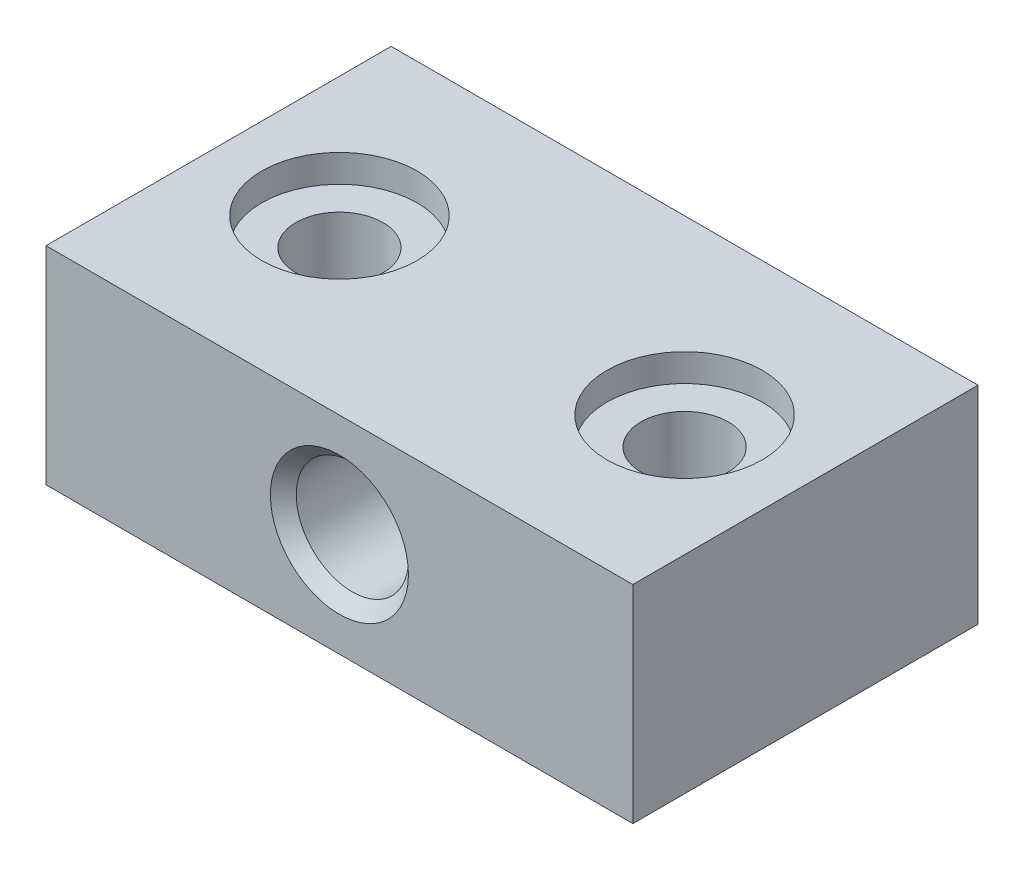
ISO-10303-21;
HEADER;
FILE_DESCRIPTION(('STEP AP214'),'2;1');
FILE_NAME('part.step','',(''),(''),'','','');
FILE_SCHEMA(('AUTOMOTIVE_DESIGN { 1 0 10303 214 1 1 1 1 }'));
ENDSEC;
DATA;
#1=APPLICATION_CONTEXT('core data for automotive mechanical design processes');
#2=APPLICATION_PROTOCOL_DEFINITION('international standard','automotive_design',2000,#1);
#3=PRODUCT_CONTEXT('',#1,'mechanical');
#4=PRODUCT('Part','Part','',(#3));
#5=PRODUCT_RELATED_PRODUCT_CATEGORY('part','',(#4));
#6=PRODUCT_DEFINITION_FORMATION('','',#4);
#7=PRODUCT_DEFINITION_CONTEXT('part definition',#1,'design');
#8=PRODUCT_DEFINITION('design','',#6,#7);
#9=PRODUCT_DEFINITION_SHAPE('','',#8);
#10=(LENGTH_UNIT() NAMED_UNIT(*) SI_UNIT(.MILLI.,.METRE.));
#11=(NAMED_UNIT(*) PLANE_ANGLE_UNIT() SI_UNIT($,.RADIAN.));
#12=(NAMED_UNIT(*) SI_UNIT($,.STERADIAN.) SOLID_ANGLE_UNIT());
#13=UNCERTAINTY_MEASURE_WITH_UNIT(LENGTH_MEASURE(1.E-05),#10,'distance_accuracy_value','');
#14=(GEOMETRIC_REPRESENTATION_CONTEXT(3) GLOBAL_UNCERTAINTY_ASSIGNED_CONTEXT((#13)) GLOBAL_UNIT_ASSIGNED_CONTEXT((#10,
#11,#12)) REPRESENTATION_CONTEXT('',''));
#15=CARTESIAN_POINT('',(0.,0.,0.));
#16=DIRECTION('',(0.,0.,1.));
#17=DIRECTION('',(1.,0.,0.));
#18=AXIS2_PLACEMENT_3D('',#15,#16,#17);
#19=CARTESIAN_POINT('',(-10.,-14.,-10.));
#20=DIRECTION('',(0.,1.,0.));
#21=DIRECTION('',(0.,0.,1.));
#22=AXIS2_PLACEMENT_3D('',#19,#20,#21);
#23=CYLINDRICAL_SURFACE('',#22,2.525);
#24=CARTESIAN_POINT('',(-10.,4.4,-10.));
#25=DIRECTION('',(0.,1.,0.));
#26=DIRECTION('',(0.,0.,1.));
#27=AXIS2_PLACEMENT_3D('',#24,#25,#26);
#28=CIRCLE('',#27,2.525);
#29=CARTESIAN_POINT('',(-10.,4.4,-7.475));
#30=VERTEX_POINT('',#29);
#31=EDGE_CURVE('E251',#30,#30,#28,.F.);
#32=ORIENTED_EDGE('',*,*,#31,.F.);
#33=EDGE_LOOP('',(#32));
#34=FACE_BOUND('',#33,.T.);
#35=CARTESIAN_POINT('',(-10.,-1.03,-10.));
#36=DIRECTION('',(0.,-1.,0.));
#37=DIRECTION('',(0.,0.,-1.));
#38=AXIS2_PLACEMENT_3D('',#35,#36,#37);
#39=CIRCLE('',#38,2.525);
#40=CARTESIAN_POINT('',(-10.,-1.03,-12.525));
#41=VERTEX_POINT('',#40);
#42=EDGE_CURVE('E193',#41,#41,#39,.F.);
#43=ORIENTED_EDGE('',*,*,#42,.F.);
#44=EDGE_LOOP('',(#43));
#45=FACE_BOUND('',#44,.T.);
#46=ADVANCED_FACE('F32',(#34,#45),#23,.F.);
#47=CARTESIAN_POINT('',(10.,-14.,-10.));
#48=DIRECTION('',(0.,1.,0.));
#49=DIRECTION('',(0.,0.,1.));
#50=AXIS2_PLACEMENT_3D('',#47,#48,#49);
#51=CYLINDRICAL_SURFACE('',#50,2.525);
#52=CARTESIAN_POINT('',(10.,4.4,-10.));
#53=DIRECTION('',(0.,1.,0.));
#54=DIRECTION('',(0.,0.,1.));
#55=AXIS2_PLACEMENT_3D('',#52,#53,#54);
#56=CIRCLE('',#55,2.525);
#57=CARTESIAN_POINT('',(10.,4.4,-7.475));
#58=VERTEX_POINT('',#57);
#59=EDGE_CURVE('E258',#58,#58,#56,.F.);
#60=ORIENTED_EDGE('',*,*,#59,.F.);
#61=EDGE_LOOP('',(#60));
#62=FACE_BOUND('',#61,.T.);
#63=CARTESIAN_POINT('',(10.,-1.03,-10.));
#64=DIRECTION('',(0.,-1.,0.));
#65=DIRECTION('',(0.,0.,-1.));
#66=AXIS2_PLACEMENT_3D('',#63,#64,#65);
#67=CIRCLE('',#66,2.525);
#68=CARTESIAN_POINT('',(10.,-1.03,-12.525));
#69=VERTEX_POINT('',#68);
#70=EDGE_CURVE('E238',#69,#69,#67,.F.);
#71=ORIENTED_EDGE('',*,*,#70,.F.);
#72=EDGE_LOOP('',(#71));
#73=FACE_BOUND('',#72,.T.);
#74=ADVANCED_FACE('F322',(#62,#73),#51,.F.);
#75=CARTESIAN_POINT('',(17.,6.,-20.));
#76=DIRECTION('',(1.,0.,0.));
#77=DIRECTION('',(0.,0.,-1.));
#78=AXIS2_PLACEMENT_3D('',#75,#76,#77);
#79=PLANE('',#78);
#80=DIRECTION('',(0.,1.,0.));
#81=VECTOR('',#80,1.);
#82=CARTESIAN_POINT('',(17.,6.,0.));
#83=LINE('',#82,#81);
#84=CARTESIAN_POINT('',(17.,-6.,0.));
#85=VERTEX_POINT('',#84);
#86=CARTESIAN_POINT('',(17.,6.,0.));
#87=VERTEX_POINT('',#86);
#88=EDGE_CURVE('E276',#85,#87,#83,.T.);
#89=ORIENTED_EDGE('',*,*,#88,.F.);
#90=DIRECTION('',(0.,0.,1.));
#91=VECTOR('',#90,1.);
#92=CARTESIAN_POINT('',(17.,-6.,-20.));
#93=LINE('',#92,#91);
#94=CARTESIAN_POINT('',(17.,-6.,-20.));
#95=VERTEX_POINT('',#94);
#96=EDGE_CURVE('E287',#95,#85,#93,.T.);
#97=ORIENTED_EDGE('',*,*,#96,.F.);
#98=DIRECTION('',(0.,1.,0.));
#99=VECTOR('',#98,1.);
#100=CARTESIAN_POINT('',(17.,6.,-20.));
#101=LINE('',#100,#99);
#102=CARTESIAN_POINT('',(17.,6.,-20.));
#103=VERTEX_POINT('',#102);
#104=EDGE_CURVE('E262',#95,#103,#101,.T.);
#105=ORIENTED_EDGE('',*,*,#104,.T.);
#106=DIRECTION('',(0.,0.,1.));
#107=VECTOR('',#106,1.);
#108=CARTESIAN_POINT('',(17.,6.,-20.));
#109=LINE('',#108,#107);
#110=EDGE_CURVE('E275',#103,#87,#109,.T.);
#111=ORIENTED_EDGE('',*,*,#110,.T.);
#112=EDGE_LOOP('',(#89,#97,#105,#111));
#113=FACE_BOUND('',#112,.T.);
#114=ADVANCED_FACE('F328',(#113),#79,.T.);
#115=CARTESIAN_POINT('',(-17.,-6.,-20.));
#116=DIRECTION('',(0.,-1.,0.));
#117=DIRECTION('',(0.,0.,-1.));
#118=AXIS2_PLACEMENT_3D('',#115,#116,#117);
#119=PLANE('',#118);
#120=DIRECTION('',(-0.866025403784439,0.,0.5));
#121=VECTOR('',#120,1.);
#122=CARTESIAN_POINT('',(-5.99896263451589,-6.,-7.69));
#123=LINE('',#122,#121);
#124=CARTESIAN_POINT('',(-5.99896263451589,-6.,-7.69));
#125=VERTEX_POINT('',#124);
#126=CARTESIAN_POINT('',(-10.,-6.,-5.38));
#127=VERTEX_POINT('',#126);
#128=EDGE_CURVE('E47',#125,#127,#123,.T.);
#129=ORIENTED_EDGE('',*,*,#128,.F.);
#130=DIRECTION('',(0.,0.,1.));
#131=VECTOR('',#130,1.);
#132=CARTESIAN_POINT('',(-5.99896263451589,-6.,-12.31));
#133=LINE('',#132,#131);
#134=CARTESIAN_POINT('',(-5.99896263451589,-6.,-12.31));
#135=VERTEX_POINT('',#134);
#136=EDGE_CURVE('E167',#135,#125,#133,.T.);
#137=ORIENTED_EDGE('',*,*,#136,.F.);
#138=DIRECTION('',(0.866025403784439,0.,0.5));
#139=VECTOR('',#138,1.);
#140=CARTESIAN_POINT('',(-10.,-6.,-14.62));
#141=LINE('',#140,#139);
#142=CARTESIAN_POINT('',(-10.,-6.,-14.62));
#143=VERTEX_POINT('',#142);
#144=EDGE_CURVE('E170',#143,#135,#141,.T.);
#145=ORIENTED_EDGE('',*,*,#144,.F.);
#146=DIRECTION('',(0.866025403784439,0.,-0.5));
#147=VECTOR('',#146,1.);
#148=CARTESIAN_POINT('',(-14.0010373654841,-6.,-12.31));
#149=LINE('',#148,#147);
#150=CARTESIAN_POINT('',(-14.0010373654841,-6.,-12.31));
#151=VERTEX_POINT('',#150);
#152=EDGE_CURVE('E186',#151,#143,#149,.T.);
#153=ORIENTED_EDGE('',*,*,#152,.F.);
#154=DIRECTION('',(0.,0.,-1.));
#155=VECTOR('',#154,1.);
#156=CARTESIAN_POINT('',(-14.0010373654841,-6.,-7.69));
#157=LINE('',#156,#155);
#158=CARTESIAN_POINT('',(-14.0010373654841,-6.,-7.69));
#159=VERTEX_POINT('',#158);
#160=EDGE_CURVE('E183',#159,#151,#157,.T.);
#161=ORIENTED_EDGE('',*,*,#160,.F.);
#162=DIRECTION('',(-0.866025403784439,0.,-0.5));
#163=VECTOR('',#162,1.);
#164=CARTESIAN_POINT('',(-10.,-6.,-5.38));
#165=LINE('',#164,#163);
#166=EDGE_CURVE('E181',#127,#159,#165,.T.);
#167=ORIENTED_EDGE('',*,*,#166,.F.);
#168=EDGE_LOOP('',(#129,#137,#145,#153,#161,#167));
#169=FACE_BOUND('',#168,.T.);
#170=DIRECTION('',(-0.866025403784438,0.,0.5));
#171=VECTOR('',#170,1.);
#172=CARTESIAN_POINT('',(14.0010373654841,-6.,-7.69));
#173=LINE('',#172,#171);
#174=CARTESIAN_POINT('',(14.0010373654841,-6.,-7.69));
#175=VERTEX_POINT('',#174);
#176=CARTESIAN_POINT('',(10.,-6.,-5.38));
#177=VERTEX_POINT('',#176);
#178=EDGE_CURVE('E55',#175,#177,#173,.T.);
#179=ORIENTED_EDGE('',*,*,#178,.F.);
#180=DIRECTION('',(0.,0.,1.));
#181=VECTOR('',#180,1.);
#182=CARTESIAN_POINT('',(14.0010373654841,-6.,-12.31));
#183=LINE('',#182,#181);
#184=CARTESIAN_POINT('',(14.0010373654841,-6.,-12.31));
#185=VERTEX_POINT('',#184);
#186=EDGE_CURVE('E205',#185,#175,#183,.T.);
#187=ORIENTED_EDGE('',*,*,#186,.F.);
#188=DIRECTION('',(0.866025403784439,0.,0.5));
#189=VECTOR('',#188,1.);
#190=CARTESIAN_POINT('',(10.,-6.,-14.62));
#191=LINE('',#190,#189);
#192=CARTESIAN_POINT('',(10.,-6.,-14.62));
#193=VERTEX_POINT('',#192);
#194=EDGE_CURVE('E231',#193,#185,#191,.T.);
#195=ORIENTED_EDGE('',*,*,#194,.F.);
#196=DIRECTION('',(0.866025403784439,0.,-0.5));
#197=VECTOR('',#196,1.);
#198=CARTESIAN_POINT('',(5.99896263451589,-6.,-12.31));
#199=LINE('',#198,#197);
#200=CARTESIAN_POINT('',(5.99896263451589,-6.,-12.31));
#201=VERTEX_POINT('',#200);
#202=EDGE_CURVE('E228',#201,#193,#199,.T.);
#203=ORIENTED_EDGE('',*,*,#202,.F.);
#204=DIRECTION('',(0.,0.,-1.));
#205=VECTOR('',#204,1.);
#206=CARTESIAN_POINT('',(5.99896263451589,-6.,-7.69));
#207=LINE('',#206,#205);
#208=CARTESIAN_POINT('',(5.99896263451589,-6.,-7.69));
#209=VERTEX_POINT('',#208);
#210=EDGE_CURVE('E225',#209,#201,#207,.T.);
#211=ORIENTED_EDGE('',*,*,#210,.F.);
#212=DIRECTION('',(-0.866025403784439,0.,-0.5));
#213=VECTOR('',#212,1.);
#214=CARTESIAN_POINT('',(10.,-6.,-5.38));
#215=LINE('',#214,#213);
#216=EDGE_CURVE('E222',#177,#209,#215,.T.);
#217=ORIENTED_EDGE('',*,*,#216,.F.);
#218=EDGE_LOOP('',(#179,#187,#195,#203,#211,#217));
#219=FACE_BOUND('',#218,.T.);
#220=DIRECTION('',(1.,0.,0.));
#221=VECTOR('',#220,1.);
#222=CARTESIAN_POINT('',(-17.,-6.,0.));
#223=LINE('',#222,#221);
#224=CARTESIAN_POINT('',(-17.,-6.,0.));
#225=VERTEX_POINT('',#224);
#226=EDGE_CURVE('E266',#225,#85,#223,.T.);
#227=ORIENTED_EDGE('',*,*,#226,.F.);
#228=DIRECTION('',(0.,0.,1.));
#229=VECTOR('',#228,1.);
#230=CARTESIAN_POINT('',(-17.,-6.,-20.));
#231=LINE('',#230,#229);
#232=CARTESIAN_POINT('',(-17.,-6.,-20.));
#233=VERTEX_POINT('',#232);
#234=EDGE_CURVE('E290',#233,#225,#231,.T.);
#235=ORIENTED_EDGE('',*,*,#234,.F.);
#236=DIRECTION('',(1.,0.,0.));
#237=VECTOR('',#236,1.);
#238=CARTESIAN_POINT('',(-17.,-6.,-20.));
#239=LINE('',#238,#237);
#240=EDGE_CURVE('E272',#233,#95,#239,.T.);
#241=ORIENTED_EDGE('',*,*,#240,.T.);
#242=ORIENTED_EDGE('',*,*,#96,.T.);
#243=EDGE_LOOP('',(#227,#235,#241,#242));
#244=FACE_BOUND('',#243,.T.);
#245=ADVANCED_FACE('F347',(#169,#219,#244),#119,.T.);
#246=CARTESIAN_POINT('',(-17.,6.,-20.));
#247=DIRECTION('',(-1.,0.,0.));
#248=DIRECTION('',(0.,0.,1.));
#249=AXIS2_PLACEMENT_3D('',#246,#247,#248);
#250=PLANE('',#249);
#251=DIRECTION('',(0.,-1.,0.));
#252=VECTOR('',#251,1.);
#253=CARTESIAN_POINT('',(-17.,6.,0.));
#254=LINE('',#253,#252);
#255=CARTESIAN_POINT('',(-17.,6.,0.));
#256=VERTEX_POINT('',#255);
#257=EDGE_CURVE('E282',#256,#225,#254,.T.);
#258=ORIENTED_EDGE('',*,*,#257,.F.);
#259=DIRECTION('',(0.,0.,1.));
#260=VECTOR('',#259,1.);
#261=CARTESIAN_POINT('',(-17.,6.,-20.));
#262=LINE('',#261,#260);
#263=CARTESIAN_POINT('',(-17.,6.,-20.));
#264=VERTEX_POINT('',#263);
#265=EDGE_CURVE('E292',#264,#256,#262,.T.);
#266=ORIENTED_EDGE('',*,*,#265,.F.);
#267=DIRECTION('',(0.,-1.,0.));
#268=VECTOR('',#267,1.);
#269=CARTESIAN_POINT('',(-17.,6.,-20.));
#270=LINE('',#269,#268);
#271=EDGE_CURVE('E269',#264,#233,#270,.T.);
#272=ORIENTED_EDGE('',*,*,#271,.T.);
#273=ORIENTED_EDGE('',*,*,#234,.T.);
#274=EDGE_LOOP('',(#258,#266,#272,#273));
#275=FACE_BOUND('',#274,.T.);
#276=ADVANCED_FACE('F350',(#275),#250,.T.);
#277=CARTESIAN_POINT('',(-17.,6.,-20.));
#278=DIRECTION('',(0.,1.,0.));
#279=DIRECTION('',(0.,0.,1.));
#280=AXIS2_PLACEMENT_3D('',#277,#278,#279);
#281=PLANE('',#280);
#282=CARTESIAN_POINT('',(-10.,6.,-10.));
#283=DIRECTION('',(0.,1.,0.));
#284=DIRECTION('',(0.,0.,1.));
#285=AXIS2_PLACEMENT_3D('',#282,#283,#284);
#286=CIRCLE('',#285,4.5);
#287=CARTESIAN_POINT('',(-10.,6.,-5.5));
#288=VERTEX_POINT('',#287);
#289=EDGE_CURVE('E252',#288,#288,#286,.T.);
#290=ORIENTED_EDGE('',*,*,#289,.F.);
#291=EDGE_LOOP('',(#290));
#292=FACE_BOUND('',#291,.T.);
#293=CARTESIAN_POINT('',(10.,6.,-10.));
#294=DIRECTION('',(0.,1.,0.));
#295=DIRECTION('',(0.,0.,1.));
#296=AXIS2_PLACEMENT_3D('',#293,#294,#295);
#297=CIRCLE('',#296,4.5);
#298=CARTESIAN_POINT('',(10.,6.,-5.5));
#299=VERTEX_POINT('',#298);
#300=EDGE_CURVE('E259',#299,#299,#297,.T.);
#301=ORIENTED_EDGE('',*,*,#300,.F.);
#302=EDGE_LOOP('',(#301));
#303=FACE_BOUND('',#302,.T.);
#304=DIRECTION('',(-1.,0.,0.));
#305=VECTOR('',#304,1.);
#306=CARTESIAN_POINT('',(-17.,6.,0.));
#307=LINE('',#306,#305);
#308=EDGE_CURVE('E279',#87,#256,#307,.T.);
#309=ORIENTED_EDGE('',*,*,#308,.F.);
#310=ORIENTED_EDGE('',*,*,#110,.F.);
#311=DIRECTION('',(-1.,0.,0.));
#312=VECTOR('',#311,1.);
#313=CARTESIAN_POINT('',(-17.,6.,-20.));
#314=LINE('',#313,#312);
#315=EDGE_CURVE('E265',#103,#264,#314,.T.);
#316=ORIENTED_EDGE('',*,*,#315,.T.);
#317=ORIENTED_EDGE('',*,*,#265,.T.);
#318=EDGE_LOOP('',(#309,#310,#316,#317));
#319=FACE_BOUND('',#318,.T.);
#320=ADVANCED_FACE('F342',(#292,#303,#319),#281,.T.);
#321=CARTESIAN_POINT('',(0.,0.,-20.));
#322=DIRECTION('',(0.,0.,1.));
#323=DIRECTION('',(1.,0.,0.));
#324=AXIS2_PLACEMENT_3D('',#321,#322,#323);
#325=PLANE('',#324);
#326=CARTESIAN_POINT('',(0.,0.,-20.));
#327=DIRECTION('',(0.,0.,1.));
#328=DIRECTION('',(1.,0.,0.));
#329=AXIS2_PLACEMENT_3D('',#326,#327,#328);
#330=CIRCLE('',#329,4.);
#331=CARTESIAN_POINT('',(4.,0.,-20.));
#332=VERTEX_POINT('',#331);
#333=EDGE_CURVE('E289',#332,#332,#330,.T.);
#334=ORIENTED_EDGE('',*,*,#333,.T.);
#335=EDGE_LOOP('',(#334));
#336=FACE_BOUND('',#335,.T.);
#337=ORIENTED_EDGE('',*,*,#104,.F.);
#338=ORIENTED_EDGE('',*,*,#240,.F.);
#339=ORIENTED_EDGE('',*,*,#271,.F.);
#340=ORIENTED_EDGE('',*,*,#315,.F.);
#341=EDGE_LOOP('',(#337,#338,#339,#340));
#342=FACE_BOUND('',#341,.T.);
#343=ADVANCED_FACE('F339',(#336,#342),#325,.F.);
#344=CARTESIAN_POINT('',(0.,0.,0.));
#345=DIRECTION('',(0.,0.,1.));
#346=DIRECTION('',(1.,0.,0.));
#347=AXIS2_PLACEMENT_3D('',#344,#345,#346);
#348=PLANE('',#347);
#349=CARTESIAN_POINT('',(0.,0.,0.));
#350=DIRECTION('',(0.,0.,1.));
#351=DIRECTION('',(1.,0.,0.));
#352=AXIS2_PLACEMENT_3D('',#349,#350,#351);
#353=CIRCLE('',#352,4.);
#354=CARTESIAN_POINT('',(4.,0.,0.));
#355=VERTEX_POINT('',#354);
#356=EDGE_CURVE('E11',#355,#355,#353,.F.);
#357=ORIENTED_EDGE('',*,*,#356,.T.);
#358=EDGE_LOOP('',(#357));
#359=FACE_BOUND('',#358,.T.);
#360=ORIENTED_EDGE('',*,*,#88,.T.);
#361=ORIENTED_EDGE('',*,*,#308,.T.);
#362=ORIENTED_EDGE('',*,*,#257,.T.);
#363=ORIENTED_EDGE('',*,*,#226,.T.);
#364=EDGE_LOOP('',(#360,#361,#362,#363));
#365=FACE_BOUND('',#364,.T.);
#366=ADVANCED_FACE('F338',(#359,#365),#348,.T.);
#367=CARTESIAN_POINT('',(0.,0.,-20.));
#368=DIRECTION('',(0.,0.,1.));
#369=DIRECTION('',(1.,0.,0.));
#370=AXIS2_PLACEMENT_3D('',#367,#368,#369);
#371=CYLINDRICAL_SURFACE('',#370,3.25);
#372=CARTESIAN_POINT('',(0.,0.,-0.749999999999994));
#373=DIRECTION('',(0.,0.,1.));
#374=DIRECTION('',(1.,0.,0.));
#375=AXIS2_PLACEMENT_3D('',#372,#373,#374);
#376=CIRCLE('',#375,3.25);
#377=CARTESIAN_POINT('',(3.25,0.,-0.749999999999994));
#378=VERTEX_POINT('',#377);
#379=EDGE_CURVE('E40',#378,#378,#376,.T.);
#380=ORIENTED_EDGE('',*,*,#379,.T.);
#381=EDGE_LOOP('',(#380));
#382=FACE_BOUND('',#381,.T.);
#383=CARTESIAN_POINT('',(0.,0.,-19.25));
#384=DIRECTION('',(0.,0.,1.));
#385=DIRECTION('',(1.,0.,0.));
#386=AXIS2_PLACEMENT_3D('',#383,#384,#385);
#387=CIRCLE('',#386,3.25);
#388=CARTESIAN_POINT('',(3.25,0.,-19.25));
#389=VERTEX_POINT('',#388);
#390=EDGE_CURVE('E305',#389,#389,#387,.F.);
#391=ORIENTED_EDGE('',*,*,#390,.T.);
#392=EDGE_LOOP('',(#391));
#393=FACE_BOUND('',#392,.T.);
#394=ADVANCED_FACE('F310',(#382,#393),#371,.F.);
#395=CARTESIAN_POINT('',(10.,4.4,-10.));
#396=DIRECTION('',(0.,1.,0.));
#397=DIRECTION('',(0.,0.,1.));
#398=AXIS2_PLACEMENT_3D('',#395,#396,#397);
#399=PLANE('',#398);
#400=CARTESIAN_POINT('',(10.,4.4,-10.));
#401=DIRECTION('',(0.,1.,0.));
#402=DIRECTION('',(0.,0.,1.));
#403=AXIS2_PLACEMENT_3D('',#400,#401,#402);
#404=CIRCLE('',#403,4.5);
#405=CARTESIAN_POINT('',(10.,4.4,-5.5));
#406=VERTEX_POINT('',#405);
#407=EDGE_CURVE('E255',#406,#406,#404,.T.);
#408=ORIENTED_EDGE('',*,*,#407,.T.);
#409=EDGE_LOOP('',(#408));
#410=FACE_BOUND('',#409,.T.);
#411=ORIENTED_EDGE('',*,*,#59,.T.);
#412=EDGE_LOOP('',(#411));
#413=FACE_BOUND('',#412,.T.);
#414=ADVANCED_FACE('F337',(#410,#413),#399,.T.);
#415=CARTESIAN_POINT('',(10.,4.4,-10.));
#416=DIRECTION('',(0.,1.,0.));
#417=DIRECTION('',(0.,0.,1.));
#418=AXIS2_PLACEMENT_3D('',#415,#416,#417);
#419=CYLINDRICAL_SURFACE('',#418,4.5);
#420=ORIENTED_EDGE('',*,*,#407,.F.);
#421=EDGE_LOOP('',(#420));
#422=FACE_BOUND('',#421,.T.);
#423=ORIENTED_EDGE('',*,*,#300,.T.);
#424=EDGE_LOOP('',(#423));
#425=FACE_BOUND('',#424,.T.);
#426=ADVANCED_FACE('F409',(#422,#425),#419,.F.);
#427=CARTESIAN_POINT('',(-10.,4.4,-10.));
#428=DIRECTION('',(0.,1.,0.));
#429=DIRECTION('',(0.,0.,1.));
#430=AXIS2_PLACEMENT_3D('',#427,#428,#429);
#431=PLANE('',#430);
#432=CARTESIAN_POINT('',(-10.,4.4,-10.));
#433=DIRECTION('',(0.,1.,0.));
#434=DIRECTION('',(0.,0.,1.));
#435=AXIS2_PLACEMENT_3D('',#432,#433,#434);
#436=CIRCLE('',#435,4.5);
#437=CARTESIAN_POINT('',(-10.,4.4,-5.5));
#438=VERTEX_POINT('',#437);
#439=EDGE_CURVE('E248',#438,#438,#436,.T.);
#440=ORIENTED_EDGE('',*,*,#439,.T.);
#441=EDGE_LOOP('',(#440));
#442=FACE_BOUND('',#441,.T.);
#443=ORIENTED_EDGE('',*,*,#31,.T.);
#444=EDGE_LOOP('',(#443));
#445=FACE_BOUND('',#444,.T.);
#446=ADVANCED_FACE('F417',(#442,#445),#431,.T.);
#447=CARTESIAN_POINT('',(-10.,4.4,-10.));
#448=DIRECTION('',(0.,1.,0.));
#449=DIRECTION('',(0.,0.,1.));
#450=AXIS2_PLACEMENT_3D('',#447,#448,#449);
#451=CYLINDRICAL_SURFACE('',#450,4.5);
#452=ORIENTED_EDGE('',*,*,#439,.F.);
#453=EDGE_LOOP('',(#452));
#454=FACE_BOUND('',#453,.T.);
#455=ORIENTED_EDGE('',*,*,#289,.T.);
#456=EDGE_LOOP('',(#455));
#457=FACE_BOUND('',#456,.T.);
#458=ADVANCED_FACE('F424',(#454,#457),#451,.F.);
#459=CARTESIAN_POINT('',(0.,-1.03,0.));
#460=DIRECTION('',(0.,-1.,0.));
#461=DIRECTION('',(0.,0.,-1.));
#462=AXIS2_PLACEMENT_3D('',#459,#460,#461);
#463=PLANE('',#462);
#464=DIRECTION('',(-0.866025403784438,0.,0.5));
#465=VECTOR('',#464,1.);
#466=CARTESIAN_POINT('',(14.0010373654841,-1.03,-7.69));
#467=LINE('',#466,#465);
#468=CARTESIAN_POINT('',(14.0010373654841,-1.03,-7.69));
#469=VERTEX_POINT('',#468);
#470=CARTESIAN_POINT('',(10.,-1.03,-5.38));
#471=VERTEX_POINT('',#470);
#472=EDGE_CURVE('E201',#469,#471,#467,.T.);
#473=ORIENTED_EDGE('',*,*,#472,.T.);
#474=DIRECTION('',(-0.866025403784439,0.,-0.5));
#475=VECTOR('',#474,1.);
#476=CARTESIAN_POINT('',(10.,-1.03,-5.38));
#477=LINE('',#476,#475);
#478=CARTESIAN_POINT('',(5.99896263451589,-1.03,-7.69));
#479=VERTEX_POINT('',#478);
#480=EDGE_CURVE('E204',#471,#479,#477,.T.);
#481=ORIENTED_EDGE('',*,*,#480,.T.);
#482=DIRECTION('',(0.,0.,-1.));
#483=VECTOR('',#482,1.);
#484=CARTESIAN_POINT('',(5.99896263451589,-1.03,-7.69));
#485=LINE('',#484,#483);
#486=CARTESIAN_POINT('',(5.99896263451589,-1.03,-12.31));
#487=VERTEX_POINT('',#486);
#488=EDGE_CURVE('E208',#479,#487,#485,.T.);
#489=ORIENTED_EDGE('',*,*,#488,.T.);
#490=DIRECTION('',(0.866025403784439,0.,-0.5));
#491=VECTOR('',#490,1.);
#492=CARTESIAN_POINT('',(5.99896263451589,-1.03,-12.31));
#493=LINE('',#492,#491);
#494=CARTESIAN_POINT('',(10.,-1.03,-14.62));
#495=VERTEX_POINT('',#494);
#496=EDGE_CURVE('E211',#487,#495,#493,.T.);
#497=ORIENTED_EDGE('',*,*,#496,.T.);
#498=DIRECTION('',(0.866025403784439,0.,0.5));
#499=VECTOR('',#498,1.);
#500=CARTESIAN_POINT('',(10.,-1.03,-14.62));
#501=LINE('',#500,#499);
#502=CARTESIAN_POINT('',(14.0010373654841,-1.03,-12.31));
#503=VERTEX_POINT('',#502);
#504=EDGE_CURVE('E214',#495,#503,#501,.T.);
#505=ORIENTED_EDGE('',*,*,#504,.T.);
#506=DIRECTION('',(0.,0.,1.));
#507=VECTOR('',#506,1.);
#508=CARTESIAN_POINT('',(14.0010373654841,-1.03,-12.31));
#509=LINE('',#508,#507);
#510=EDGE_CURVE('E217',#503,#469,#509,.T.);
#511=ORIENTED_EDGE('',*,*,#510,.T.);
#512=EDGE_LOOP('',(#473,#481,#489,#497,#505,#511));
#513=FACE_BOUND('',#512,.T.);
#514=ORIENTED_EDGE('',*,*,#70,.T.);
#515=EDGE_LOOP('',(#514));
#516=FACE_BOUND('',#515,.T.);
#517=ADVANCED_FACE('F432',(#513,#516),#463,.T.);
#518=CARTESIAN_POINT('',(14.0010373654841,-1.03,-7.69));
#519=DIRECTION('',(0.5,0.,0.866025403784438));
#520=DIRECTION('',(0.866025403784439,0.,-0.5));
#521=AXIS2_PLACEMENT_3D('',#518,#519,#520);
#522=PLANE('',#521);
#523=ORIENTED_EDGE('',*,*,#178,.T.);
#524=DIRECTION('',(0.,-1.,0.));
#525=VECTOR('',#524,1.);
#526=CARTESIAN_POINT('',(10.,-1.03,-5.38));
#527=LINE('',#526,#525);
#528=EDGE_CURVE('E220',#471,#177,#527,.T.);
#529=ORIENTED_EDGE('',*,*,#528,.F.);
#530=ORIENTED_EDGE('',*,*,#472,.F.);
#531=DIRECTION('',(0.,-1.,0.));
#532=VECTOR('',#531,1.);
#533=CARTESIAN_POINT('',(14.0010373654841,-1.03,-7.69));
#534=LINE('',#533,#532);
#535=EDGE_CURVE('E236',#469,#175,#534,.T.);
#536=ORIENTED_EDGE('',*,*,#535,.T.);
#537=EDGE_LOOP('',(#523,#529,#530,#536));
#538=FACE_BOUND('',#537,.T.);
#539=ADVANCED_FACE('F439',(#538),#522,.F.);
#540=CARTESIAN_POINT('',(14.0010373654841,-1.03,-12.31));
#541=DIRECTION('',(1.,0.,0.));
#542=DIRECTION('',(0.,0.,-1.));
#543=AXIS2_PLACEMENT_3D('',#540,#541,#542);
#544=PLANE('',#543);
#545=ORIENTED_EDGE('',*,*,#186,.T.);
#546=ORIENTED_EDGE('',*,*,#535,.F.);
#547=ORIENTED_EDGE('',*,*,#510,.F.);
#548=DIRECTION('',(0.,-1.,0.));
#549=VECTOR('',#548,1.);
#550=CARTESIAN_POINT('',(14.0010373654841,-1.03,-12.31));
#551=LINE('',#550,#549);
#552=EDGE_CURVE('E239',#503,#185,#551,.T.);
#553=ORIENTED_EDGE('',*,*,#552,.T.);
#554=EDGE_LOOP('',(#545,#546,#547,#553));
#555=FACE_BOUND('',#554,.T.);
#556=ADVANCED_FACE('F447',(#555),#544,.F.);
#557=CARTESIAN_POINT('',(10.,-1.03,-14.62));
#558=DIRECTION('',(0.5,0.,-0.866025403784439));
#559=DIRECTION('',(-0.866025403784439,0.,-0.5));
#560=AXIS2_PLACEMENT_3D('',#557,#558,#559);
#561=PLANE('',#560);
#562=ORIENTED_EDGE('',*,*,#194,.T.);
#563=ORIENTED_EDGE('',*,*,#552,.F.);
#564=ORIENTED_EDGE('',*,*,#504,.F.);
#565=DIRECTION('',(0.,-1.,0.));
#566=VECTOR('',#565,1.);
#567=CARTESIAN_POINT('',(10.,-1.03,-14.62));
#568=LINE('',#567,#566);
#569=EDGE_CURVE('E241',#495,#193,#568,.T.);
#570=ORIENTED_EDGE('',*,*,#569,.T.);
#571=EDGE_LOOP('',(#562,#563,#564,#570));
#572=FACE_BOUND('',#571,.T.);
#573=ADVANCED_FACE('F454',(#572),#561,.F.);
#574=CARTESIAN_POINT('',(5.99896263451589,-1.03,-12.31));
#575=DIRECTION('',(-0.5,0.,-0.866025403784439));
#576=DIRECTION('',(-0.866025403784439,0.,0.5));
#577=AXIS2_PLACEMENT_3D('',#574,#575,#576);
#578=PLANE('',#577);
#579=ORIENTED_EDGE('',*,*,#202,.T.);
#580=ORIENTED_EDGE('',*,*,#569,.F.);
#581=ORIENTED_EDGE('',*,*,#496,.F.);
#582=DIRECTION('',(0.,-1.,0.));
#583=VECTOR('',#582,1.);
#584=CARTESIAN_POINT('',(5.99896263451589,-1.03,-12.31));
#585=LINE('',#584,#583);
#586=EDGE_CURVE('E243',#487,#201,#585,.T.);
#587=ORIENTED_EDGE('',*,*,#586,.T.);
#588=EDGE_LOOP('',(#579,#580,#581,#587));
#589=FACE_BOUND('',#588,.T.);
#590=ADVANCED_FACE('F462',(#589),#578,.F.);
#591=CARTESIAN_POINT('',(5.99896263451589,-1.03,-7.69));
#592=DIRECTION('',(-1.,0.,0.));
#593=DIRECTION('',(0.,0.,1.));
#594=AXIS2_PLACEMENT_3D('',#591,#592,#593);
#595=PLANE('',#594);
#596=ORIENTED_EDGE('',*,*,#210,.T.);
#597=ORIENTED_EDGE('',*,*,#586,.F.);
#598=ORIENTED_EDGE('',*,*,#488,.F.);
#599=DIRECTION('',(0.,-1.,0.));
#600=VECTOR('',#599,1.);
#601=CARTESIAN_POINT('',(5.99896263451589,-1.03,-7.69));
#602=LINE('',#601,#600);
#603=EDGE_CURVE('E245',#479,#209,#602,.T.);
#604=ORIENTED_EDGE('',*,*,#603,.T.);
#605=EDGE_LOOP('',(#596,#597,#598,#604));
#606=FACE_BOUND('',#605,.T.);
#607=ADVANCED_FACE('F470',(#606),#595,.F.);
#608=CARTESIAN_POINT('',(10.,-1.03,-5.38));
#609=DIRECTION('',(-0.5,0.,0.866025403784439));
#610=DIRECTION('',(0.866025403784439,0.,0.5));
#611=AXIS2_PLACEMENT_3D('',#608,#609,#610);
#612=PLANE('',#611);
#613=ORIENTED_EDGE('',*,*,#216,.T.);
#614=ORIENTED_EDGE('',*,*,#603,.F.);
#615=ORIENTED_EDGE('',*,*,#480,.F.);
#616=ORIENTED_EDGE('',*,*,#528,.T.);
#617=EDGE_LOOP('',(#613,#614,#615,#616));
#618=FACE_BOUND('',#617,.T.);
#619=ADVANCED_FACE('F478',(#618),#612,.F.);
#620=CARTESIAN_POINT('',(0.,-1.03,0.));
#621=DIRECTION('',(0.,-1.,0.));
#622=DIRECTION('',(0.,0.,-1.));
#623=AXIS2_PLACEMENT_3D('',#620,#621,#622);
#624=PLANE('',#623);
#625=DIRECTION('',(-0.866025403784439,0.,0.5));
#626=VECTOR('',#625,1.);
#627=CARTESIAN_POINT('',(-5.99896263451589,-1.03,-7.69));
#628=LINE('',#627,#626);
#629=CARTESIAN_POINT('',(-5.99896263451589,-1.03,-7.69));
#630=VERTEX_POINT('',#629);
#631=CARTESIAN_POINT('',(-10.,-1.03,-5.38));
#632=VERTEX_POINT('',#631);
#633=EDGE_CURVE('E147',#630,#632,#628,.T.);
#634=ORIENTED_EDGE('',*,*,#633,.T.);
#635=DIRECTION('',(-0.866025403784439,0.,-0.5));
#636=VECTOR('',#635,1.);
#637=CARTESIAN_POINT('',(-10.,-1.03,-5.38));
#638=LINE('',#637,#636);
#639=CARTESIAN_POINT('',(-14.0010373654841,-1.03,-7.69));
#640=VERTEX_POINT('',#639);
#641=EDGE_CURVE('E156',#632,#640,#638,.T.);
#642=ORIENTED_EDGE('',*,*,#641,.T.);
#643=DIRECTION('',(0.,0.,-1.));
#644=VECTOR('',#643,1.);
#645=CARTESIAN_POINT('',(-14.0010373654841,-1.03,-7.69));
#646=LINE('',#645,#644);
#647=CARTESIAN_POINT('',(-14.0010373654841,-1.03,-12.31));
#648=VERTEX_POINT('',#647);
#649=EDGE_CURVE('E161',#640,#648,#646,.T.);
#650=ORIENTED_EDGE('',*,*,#649,.T.);
#651=DIRECTION('',(0.866025403784439,0.,-0.5));
#652=VECTOR('',#651,1.);
#653=CARTESIAN_POINT('',(-14.0010373654841,-1.03,-12.31));
#654=LINE('',#653,#652);
#655=CARTESIAN_POINT('',(-10.,-1.03,-14.62));
#656=VERTEX_POINT('',#655);
#657=EDGE_CURVE('E174',#648,#656,#654,.T.);
#658=ORIENTED_EDGE('',*,*,#657,.T.);
#659=DIRECTION('',(0.866025403784439,0.,0.5));
#660=VECTOR('',#659,1.);
#661=CARTESIAN_POINT('',(-10.,-1.03,-14.62));
#662=LINE('',#661,#660);
#663=CARTESIAN_POINT('',(-5.99896263451589,-1.03,-12.31));
#664=VERTEX_POINT('',#663);
#665=EDGE_CURVE('E177',#656,#664,#662,.T.);
#666=ORIENTED_EDGE('',*,*,#665,.T.);
#667=DIRECTION('',(0.,0.,1.));
#668=VECTOR('',#667,1.);
#669=CARTESIAN_POINT('',(-5.99896263451589,-1.03,-12.31));
#670=LINE('',#669,#668);
#671=EDGE_CURVE('E153',#664,#630,#670,.T.);
#672=ORIENTED_EDGE('',*,*,#671,.T.);
#673=EDGE_LOOP('',(#634,#642,#650,#658,#666,#672));
#674=FACE_BOUND('',#673,.T.);
#675=ORIENTED_EDGE('',*,*,#42,.T.);
#676=EDGE_LOOP('',(#675));
#677=FACE_BOUND('',#676,.T.);
#678=ADVANCED_FACE('F163',(#674,#677),#624,.T.);
#679=CARTESIAN_POINT('',(-5.99896263451589,-1.03,-7.69));
#680=DIRECTION('',(0.5,0.,0.866025403784438));
#681=DIRECTION('',(0.866025403784439,0.,-0.5));
#682=AXIS2_PLACEMENT_3D('',#679,#680,#681);
#683=PLANE('',#682);
#684=ORIENTED_EDGE('',*,*,#128,.T.);
#685=DIRECTION('',(0.,-1.,0.));
#686=VECTOR('',#685,1.);
#687=CARTESIAN_POINT('',(-10.,-1.03,-5.38));
#688=LINE('',#687,#686);
#689=EDGE_CURVE('E143',#632,#127,#688,.T.);
#690=ORIENTED_EDGE('',*,*,#689,.F.);
#691=ORIENTED_EDGE('',*,*,#633,.F.);
#692=DIRECTION('',(0.,-1.,0.));
#693=VECTOR('',#692,1.);
#694=CARTESIAN_POINT('',(-5.99896263451589,-1.03,-7.69));
#695=LINE('',#694,#693);
#696=EDGE_CURVE('E191',#630,#125,#695,.T.);
#697=ORIENTED_EDGE('',*,*,#696,.T.);
#698=EDGE_LOOP('',(#684,#690,#691,#697));
#699=FACE_BOUND('',#698,.T.);
#700=ADVANCED_FACE('F145',(#699),#683,.F.);
#701=CARTESIAN_POINT('',(-5.99896263451589,-1.03,-12.31));
#702=DIRECTION('',(1.,0.,0.));
#703=DIRECTION('',(0.,0.,-1.));
#704=AXIS2_PLACEMENT_3D('',#701,#702,#703);
#705=PLANE('',#704);
#706=ORIENTED_EDGE('',*,*,#136,.T.);
#707=ORIENTED_EDGE('',*,*,#696,.F.);
#708=ORIENTED_EDGE('',*,*,#671,.F.);
#709=DIRECTION('',(0.,-1.,0.));
#710=VECTOR('',#709,1.);
#711=CARTESIAN_POINT('',(-5.99896263451589,-1.03,-12.31));
#712=LINE('',#711,#710);
#713=EDGE_CURVE('E194',#664,#135,#712,.T.);
#714=ORIENTED_EDGE('',*,*,#713,.T.);
#715=EDGE_LOOP('',(#706,#707,#708,#714));
#716=FACE_BOUND('',#715,.T.);
#717=ADVANCED_FACE('F499',(#716),#705,.F.);
#718=CARTESIAN_POINT('',(-10.,-1.03,-14.62));
#719=DIRECTION('',(0.5,0.,-0.866025403784439));
#720=DIRECTION('',(-0.866025403784439,0.,-0.5));
#721=AXIS2_PLACEMENT_3D('',#718,#719,#720);
#722=PLANE('',#721);
#723=ORIENTED_EDGE('',*,*,#144,.T.);
#724=ORIENTED_EDGE('',*,*,#713,.F.);
#725=ORIENTED_EDGE('',*,*,#665,.F.);
#726=DIRECTION('',(0.,-1.,0.));
#727=VECTOR('',#726,1.);
#728=CARTESIAN_POINT('',(-10.,-1.03,-14.62));
#729=LINE('',#728,#727);
#730=EDGE_CURVE('E196',#656,#143,#729,.T.);
#731=ORIENTED_EDGE('',*,*,#730,.T.);
#732=EDGE_LOOP('',(#723,#724,#725,#731));
#733=FACE_BOUND('',#732,.T.);
#734=ADVANCED_FACE('F506',(#733),#722,.F.);
#735=CARTESIAN_POINT('',(-14.0010373654841,-1.03,-12.31));
#736=DIRECTION('',(-0.5,0.,-0.866025403784438));
#737=DIRECTION('',(-0.866025403784439,0.,0.5));
#738=AXIS2_PLACEMENT_3D('',#735,#736,#737);
#739=PLANE('',#738);
#740=ORIENTED_EDGE('',*,*,#152,.T.);
#741=ORIENTED_EDGE('',*,*,#730,.F.);
#742=ORIENTED_EDGE('',*,*,#657,.F.);
#743=DIRECTION('',(0.,-1.,0.));
#744=VECTOR('',#743,1.);
#745=CARTESIAN_POINT('',(-14.0010373654841,-1.03,-12.31));
#746=LINE('',#745,#744);
#747=EDGE_CURVE('E198',#648,#151,#746,.T.);
#748=ORIENTED_EDGE('',*,*,#747,.T.);
#749=EDGE_LOOP('',(#740,#741,#742,#748));
#750=FACE_BOUND('',#749,.T.);
#751=ADVANCED_FACE('F514',(#750),#739,.F.);
#752=CARTESIAN_POINT('',(-14.0010373654841,-1.03,-7.69));
#753=DIRECTION('',(-1.,0.,0.));
#754=DIRECTION('',(0.,0.,1.));
#755=AXIS2_PLACEMENT_3D('',#752,#753,#754);
#756=PLANE('',#755);
#757=ORIENTED_EDGE('',*,*,#160,.T.);
#758=ORIENTED_EDGE('',*,*,#747,.F.);
#759=ORIENTED_EDGE('',*,*,#649,.F.);
#760=DIRECTION('',(0.,-1.,0.));
#761=VECTOR('',#760,1.);
#762=CARTESIAN_POINT('',(-14.0010373654841,-1.03,-7.69));
#763=LINE('',#762,#761);
#764=EDGE_CURVE('E152',#640,#159,#763,.T.);
#765=ORIENTED_EDGE('',*,*,#764,.T.);
#766=EDGE_LOOP('',(#757,#758,#759,#765));
#767=FACE_BOUND('',#766,.T.);
#768=ADVANCED_FACE('F522',(#767),#756,.F.);
#769=CARTESIAN_POINT('',(-10.,-1.03,-5.38));
#770=DIRECTION('',(-0.5,0.,0.866025403784438));
#771=DIRECTION('',(0.866025403784439,0.,0.5));
#772=AXIS2_PLACEMENT_3D('',#769,#770,#771);
#773=PLANE('',#772);
#774=ORIENTED_EDGE('',*,*,#166,.T.);
#775=ORIENTED_EDGE('',*,*,#764,.F.);
#776=ORIENTED_EDGE('',*,*,#641,.F.);
#777=ORIENTED_EDGE('',*,*,#689,.T.);
#778=EDGE_LOOP('',(#774,#775,#776,#777));
#779=FACE_BOUND('',#778,.T.);
#780=ADVANCED_FACE('F157',(#779),#773,.F.);
#781=CARTESIAN_POINT('',(0.,0.,-20.));
#782=DIRECTION('',(0.,0.,-1.));
#783=DIRECTION('',(-1.,0.,0.));
#784=AXIS2_PLACEMENT_3D('',#781,#782,#783);
#785=CONICAL_SURFACE('',#784,4.,0.785398163397445);
#786=ORIENTED_EDGE('',*,*,#390,.F.);
#787=EDGE_LOOP('',(#786));
#788=FACE_BOUND('',#787,.T.);
#789=ORIENTED_EDGE('',*,*,#333,.F.);
#790=EDGE_LOOP('',(#789));
#791=FACE_BOUND('',#790,.T.);
#792=ADVANCED_FACE('F314',(#788,#791),#785,.F.);
#793=CARTESIAN_POINT('',(0.,0.,-0.749999999999994));
#794=DIRECTION('',(0.,0.,1.));
#795=DIRECTION('',(1.,0.,0.));
#796=AXIS2_PLACEMENT_3D('',#793,#794,#795);
#797=CONICAL_SURFACE('',#796,3.25,0.785398163397452);
#798=ORIENTED_EDGE('',*,*,#356,.F.);
#799=EDGE_LOOP('',(#798));
#800=FACE_BOUND('',#799,.T.);
#801=ORIENTED_EDGE('',*,*,#379,.F.);
#802=EDGE_LOOP('',(#801));
#803=FACE_BOUND('',#802,.T.);
#804=ADVANCED_FACE('F34',(#800,#803),#797,.F.);
#805=CLOSED_SHELL('',(#46,#74,#114,#245,#276,#320,#343,#366,#394,#414,#426,#446,#458,#517,#539,
#556,#573,#590,#607,#619,#678,#700,#717,#734,#751,#768,#780,#792,#804));
#806=MANIFOLD_SOLID_BREP('B2',#805);
#807=ADVANCED_BREP_SHAPE_REPRESENTATION('',(#18,#806),#14);
#808=SHAPE_DEFINITION_REPRESENTATION(#9,#807);
ENDSEC;
END-ISO-10303-21;
